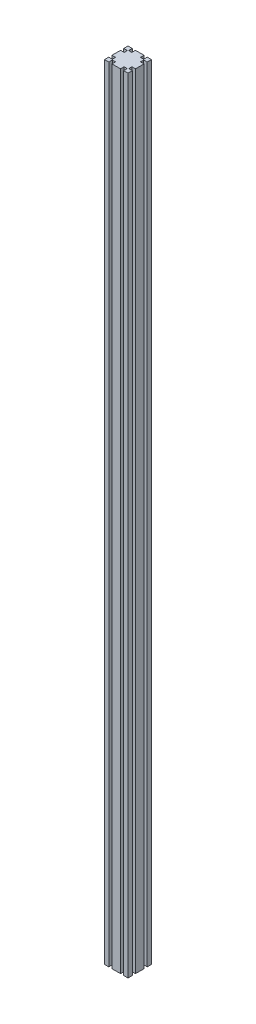
ISO-10303-21;
HEADER;
FILE_DESCRIPTION(('STEP AP214'),'2;1');
FILE_NAME('part.step','',(''),(''),'','','');
FILE_SCHEMA(('AUTOMOTIVE_DESIGN { 1 0 10303 214 1 1 1 1 }'));
ENDSEC;
DATA;
#1=APPLICATION_CONTEXT('core data for automotive mechanical design processes');
#2=APPLICATION_PROTOCOL_DEFINITION('international standard','automotive_design',2000,#1);
#3=PRODUCT_CONTEXT('',#1,'mechanical');
#4=PRODUCT('Part','Part','',(#3));
#5=PRODUCT_RELATED_PRODUCT_CATEGORY('part','',(#4));
#6=PRODUCT_DEFINITION_FORMATION('','',#4);
#7=PRODUCT_DEFINITION_CONTEXT('part definition',#1,'design');
#8=PRODUCT_DEFINITION('design','',#6,#7);
#9=PRODUCT_DEFINITION_SHAPE('','',#8);
#10=(LENGTH_UNIT() NAMED_UNIT(*) SI_UNIT(.MILLI.,.METRE.));
#11=(NAMED_UNIT(*) PLANE_ANGLE_UNIT() SI_UNIT($,.RADIAN.));
#12=(NAMED_UNIT(*) SI_UNIT($,.STERADIAN.) SOLID_ANGLE_UNIT());
#13=UNCERTAINTY_MEASURE_WITH_UNIT(LENGTH_MEASURE(1.E-05),#10,'distance_accuracy_value','');
#14=(GEOMETRIC_REPRESENTATION_CONTEXT(3) GLOBAL_UNCERTAINTY_ASSIGNED_CONTEXT((#13)) GLOBAL_UNIT_ASSIGNED_CONTEXT((#10,
#11,#12)) REPRESENTATION_CONTEXT('',''));
#15=CARTESIAN_POINT('',(0.,0.,0.));
#16=DIRECTION('',(0.,0.,1.));
#17=DIRECTION('',(1.,0.,0.));
#18=AXIS2_PLACEMENT_3D('',#15,#16,#17);
#19=CARTESIAN_POINT('',(19.1,2000.,0.));
#20=DIRECTION('',(-1.,0.,0.));
#21=DIRECTION('',(0.,0.,1.));
#22=AXIS2_PLACEMENT_3D('',#19,#20,#21);
#23=PLANE('',#22);
#24=DIRECTION('',(0.,0.,-1.));
#25=VECTOR('',#24,1.);
#26=CARTESIAN_POINT('',(19.1,0.,0.));
#27=LINE('',#26,#25);
#28=CARTESIAN_POINT('',(19.1,0.,-50.8));
#29=VERTEX_POINT('',#28);
#30=CARTESIAN_POINT('',(19.1,0.,-60.));
#31=VERTEX_POINT('',#30);
#32=EDGE_CURVE('E309',#29,#31,#27,.T.);
#33=ORIENTED_EDGE('',*,*,#32,.F.);
#34=DIRECTION('',(0.,-1.,0.));
#35=VECTOR('',#34,1.);
#36=CARTESIAN_POINT('',(19.1,2000.,-50.8));
#37=LINE('',#36,#35);
#38=CARTESIAN_POINT('',(19.1,2000.,-50.8));
#39=VERTEX_POINT('',#38);
#40=EDGE_CURVE('E11',#39,#29,#37,.T.);
#41=ORIENTED_EDGE('',*,*,#40,.F.);
#42=DIRECTION('',(0.,0.,-1.));
#43=VECTOR('',#42,1.);
#44=CARTESIAN_POINT('',(19.1,2000.,0.));
#45=LINE('',#44,#43);
#46=CARTESIAN_POINT('',(19.1,2000.,-60.));
#47=VERTEX_POINT('',#46);
#48=EDGE_CURVE('E557',#39,#47,#45,.T.);
#49=ORIENTED_EDGE('',*,*,#48,.T.);
#50=DIRECTION('',(0.,-1.,0.));
#51=VECTOR('',#50,1.);
#52=CARTESIAN_POINT('',(19.1,2000.,-60.));
#53=LINE('',#52,#51);
#54=EDGE_CURVE('E58',#47,#31,#53,.T.);
#55=ORIENTED_EDGE('',*,*,#54,.T.);
#56=EDGE_LOOP('',(#33,#41,#49,#55));
#57=FACE_BOUND('',#56,.T.);
#58=ADVANCED_FACE('F41',(#57),#23,.T.);
#59=CARTESIAN_POINT('',(0.,2000.,-50.8));
#60=DIRECTION('',(0.,0.,-1.));
#61=DIRECTION('',(-1.,0.,0.));
#62=AXIS2_PLACEMENT_3D('',#59,#60,#61);
#63=PLANE('',#62);
#64=DIRECTION('',(1.,0.,0.));
#65=VECTOR('',#64,1.);
#66=CARTESIAN_POINT('',(0.,0.,-50.8));
#67=LINE('',#66,#65);
#68=CARTESIAN_POINT('',(10.9,0.,-50.8));
#69=VERTEX_POINT('',#68);
#70=EDGE_CURVE('E312',#69,#29,#67,.T.);
#71=ORIENTED_EDGE('',*,*,#70,.F.);
#72=DIRECTION('',(0.,-1.,0.));
#73=VECTOR('',#72,1.);
#74=CARTESIAN_POINT('',(10.9,2000.,-50.8));
#75=LINE('',#74,#73);
#76=CARTESIAN_POINT('',(10.9,2000.,-50.8));
#77=VERTEX_POINT('',#76);
#78=EDGE_CURVE('E50',#77,#69,#75,.T.);
#79=ORIENTED_EDGE('',*,*,#78,.F.);
#80=DIRECTION('',(1.,0.,0.));
#81=VECTOR('',#80,1.);
#82=CARTESIAN_POINT('',(0.,2000.,-50.8));
#83=LINE('',#82,#81);
#84=EDGE_CURVE('E551',#77,#39,#83,.T.);
#85=ORIENTED_EDGE('',*,*,#84,.T.);
#86=ORIENTED_EDGE('',*,*,#40,.T.);
#87=EDGE_LOOP('',(#71,#79,#85,#86));
#88=FACE_BOUND('',#87,.T.);
#89=ADVANCED_FACE('F540',(#88),#63,.T.);
#90=CARTESIAN_POINT('',(10.9,2000.,0.));
#91=DIRECTION('',(1.,0.,0.));
#92=DIRECTION('',(0.,0.,-1.));
#93=AXIS2_PLACEMENT_3D('',#90,#91,#92);
#94=PLANE('',#93);
#95=DIRECTION('',(0.,0.,1.));
#96=VECTOR('',#95,1.);
#97=CARTESIAN_POINT('',(10.9,0.,0.));
#98=LINE('',#97,#96);
#99=CARTESIAN_POINT('',(10.9,0.,-60.));
#100=VERTEX_POINT('',#99);
#101=EDGE_CURVE('E316',#100,#69,#98,.T.);
#102=ORIENTED_EDGE('',*,*,#101,.F.);
#103=DIRECTION('',(0.,-1.,0.));
#104=VECTOR('',#103,1.);
#105=CARTESIAN_POINT('',(10.9,2000.,-60.));
#106=LINE('',#105,#104);
#107=CARTESIAN_POINT('',(10.9,2000.,-60.));
#108=VERTEX_POINT('',#107);
#109=EDGE_CURVE('E527',#108,#100,#106,.T.);
#110=ORIENTED_EDGE('',*,*,#109,.F.);
#111=DIRECTION('',(0.,0.,1.));
#112=VECTOR('',#111,1.);
#113=CARTESIAN_POINT('',(10.9,2000.,0.));
#114=LINE('',#113,#112);
#115=EDGE_CURVE('E536',#108,#77,#114,.T.);
#116=ORIENTED_EDGE('',*,*,#115,.T.);
#117=ORIENTED_EDGE('',*,*,#78,.T.);
#118=EDGE_LOOP('',(#102,#110,#116,#117));
#119=FACE_BOUND('',#118,.T.);
#120=ADVANCED_FACE('F534',(#119),#94,.T.);
#121=CARTESIAN_POINT('',(0.,2000.,-60.));
#122=DIRECTION('',(0.,0.,-1.));
#123=DIRECTION('',(-1.,0.,0.));
#124=AXIS2_PLACEMENT_3D('',#121,#122,#123);
#125=PLANE('',#124);
#126=DIRECTION('',(1.,0.,0.));
#127=VECTOR('',#126,1.);
#128=CARTESIAN_POINT('',(0.,0.,-60.));
#129=LINE('',#128,#127);
#130=CARTESIAN_POINT('',(0.,0.,-60.));
#131=VERTEX_POINT('',#130);
#132=EDGE_CURVE('E320',#131,#100,#129,.T.);
#133=ORIENTED_EDGE('',*,*,#132,.F.);
#134=DIRECTION('',(0.,-1.,0.));
#135=VECTOR('',#134,1.);
#136=CARTESIAN_POINT('',(0.,2000.,-60.));
#137=LINE('',#136,#135);
#138=CARTESIAN_POINT('',(0.,2000.,-60.));
#139=VERTEX_POINT('',#138);
#140=EDGE_CURVE('E524',#139,#131,#137,.T.);
#141=ORIENTED_EDGE('',*,*,#140,.F.);
#142=DIRECTION('',(1.,0.,0.));
#143=VECTOR('',#142,1.);
#144=CARTESIAN_POINT('',(0.,2000.,-60.));
#145=LINE('',#144,#143);
#146=EDGE_CURVE('E306',#139,#108,#145,.T.);
#147=ORIENTED_EDGE('',*,*,#146,.T.);
#148=ORIENTED_EDGE('',*,*,#109,.T.);
#149=EDGE_LOOP('',(#133,#141,#147,#148));
#150=FACE_BOUND('',#149,.T.);
#151=ADVANCED_FACE('F547',(#150),#125,.T.);
#152=CARTESIAN_POINT('',(0.,2000.,0.));
#153=DIRECTION('',(1.,0.,0.));
#154=DIRECTION('',(0.,0.,-1.));
#155=AXIS2_PLACEMENT_3D('',#152,#153,#154);
#156=PLANE('',#155);
#157=DIRECTION('',(0.,0.,1.));
#158=VECTOR('',#157,1.);
#159=CARTESIAN_POINT('',(0.,0.,0.));
#160=LINE('',#159,#158);
#161=CARTESIAN_POINT('',(0.,0.,-49.1));
#162=VERTEX_POINT('',#161);
#163=EDGE_CURVE('E324',#131,#162,#160,.T.);
#164=ORIENTED_EDGE('',*,*,#163,.T.);
#165=DIRECTION('',(0.,-1.,0.));
#166=VECTOR('',#165,1.);
#167=CARTESIAN_POINT('',(0.,2000.,-49.1));
#168=LINE('',#167,#166);
#169=CARTESIAN_POINT('',(0.,2000.,-49.1));
#170=VERTEX_POINT('',#169);
#171=EDGE_CURVE('E520',#170,#162,#168,.T.);
#172=ORIENTED_EDGE('',*,*,#171,.F.);
#173=DIRECTION('',(0.,0.,1.));
#174=VECTOR('',#173,1.);
#175=CARTESIAN_POINT('',(0.,2000.,0.));
#176=LINE('',#175,#174);
#177=EDGE_CURVE('E556',#139,#170,#176,.T.);
#178=ORIENTED_EDGE('',*,*,#177,.F.);
#179=ORIENTED_EDGE('',*,*,#140,.T.);
#180=EDGE_LOOP('',(#164,#172,#178,#179));
#181=FACE_BOUND('',#180,.T.);
#182=ADVANCED_FACE('F741',(#181),#156,.F.);
#183=CARTESIAN_POINT('',(0.,2000.,-49.1));
#184=DIRECTION('',(0.,0.,-1.));
#185=DIRECTION('',(-1.,0.,0.));
#186=AXIS2_PLACEMENT_3D('',#183,#184,#185);
#187=PLANE('',#186);
#188=DIRECTION('',(1.,0.,0.));
#189=VECTOR('',#188,1.);
#190=CARTESIAN_POINT('',(0.,0.,-49.1));
#191=LINE('',#190,#189);
#192=CARTESIAN_POINT('',(9.2,0.,-49.1));
#193=VERTEX_POINT('',#192);
#194=EDGE_CURVE('E328',#162,#193,#191,.T.);
#195=ORIENTED_EDGE('',*,*,#194,.T.);
#196=DIRECTION('',(0.,-1.,0.));
#197=VECTOR('',#196,1.);
#198=CARTESIAN_POINT('',(9.2,2000.,-49.1));
#199=LINE('',#198,#197);
#200=CARTESIAN_POINT('',(9.2,2000.,-49.1));
#201=VERTEX_POINT('',#200);
#202=EDGE_CURVE('E516',#201,#193,#199,.T.);
#203=ORIENTED_EDGE('',*,*,#202,.F.);
#204=DIRECTION('',(1.,0.,0.));
#205=VECTOR('',#204,1.);
#206=CARTESIAN_POINT('',(0.,2000.,-49.1));
#207=LINE('',#206,#205);
#208=EDGE_CURVE('E563',#170,#201,#207,.T.);
#209=ORIENTED_EDGE('',*,*,#208,.F.);
#210=ORIENTED_EDGE('',*,*,#171,.T.);
#211=EDGE_LOOP('',(#195,#203,#209,#210));
#212=FACE_BOUND('',#211,.T.);
#213=ADVANCED_FACE('F753',(#212),#187,.F.);
#214=CARTESIAN_POINT('',(9.20000000000001,2000.,0.));
#215=DIRECTION('',(1.,0.,0.));
#216=DIRECTION('',(0.,0.,-1.));
#217=AXIS2_PLACEMENT_3D('',#214,#215,#216);
#218=PLANE('',#217);
#219=DIRECTION('',(0.,0.,1.));
#220=VECTOR('',#219,1.);
#221=CARTESIAN_POINT('',(9.20000000000001,0.,0.));
#222=LINE('',#221,#220);
#223=CARTESIAN_POINT('',(9.2,0.,-40.9));
#224=VERTEX_POINT('',#223);
#225=EDGE_CURVE('E331',#193,#224,#222,.T.);
#226=ORIENTED_EDGE('',*,*,#225,.T.);
#227=DIRECTION('',(0.,-1.,0.));
#228=VECTOR('',#227,1.);
#229=CARTESIAN_POINT('',(9.2,2000.,-40.9));
#230=LINE('',#229,#228);
#231=CARTESIAN_POINT('',(9.2,2000.,-40.9));
#232=VERTEX_POINT('',#231);
#233=EDGE_CURVE('E512',#232,#224,#230,.T.);
#234=ORIENTED_EDGE('',*,*,#233,.F.);
#235=DIRECTION('',(0.,0.,1.));
#236=VECTOR('',#235,1.);
#237=CARTESIAN_POINT('',(9.20000000000001,2000.,0.));
#238=LINE('',#237,#236);
#239=EDGE_CURVE('E566',#201,#232,#238,.T.);
#240=ORIENTED_EDGE('',*,*,#239,.F.);
#241=ORIENTED_EDGE('',*,*,#202,.T.);
#242=EDGE_LOOP('',(#226,#234,#240,#241));
#243=FACE_BOUND('',#242,.T.);
#244=ADVANCED_FACE('F757',(#243),#218,.F.);
#245=CARTESIAN_POINT('',(0.,2000.,-40.9));
#246=DIRECTION('',(0.,0.,1.));
#247=DIRECTION('',(1.,0.,0.));
#248=AXIS2_PLACEMENT_3D('',#245,#246,#247);
#249=PLANE('',#248);
#250=DIRECTION('',(-1.,0.,0.));
#251=VECTOR('',#250,1.);
#252=CARTESIAN_POINT('',(0.,0.,-40.9));
#253=LINE('',#252,#251);
#254=CARTESIAN_POINT('',(0.,0.,-40.9));
#255=VERTEX_POINT('',#254);
#256=EDGE_CURVE('E334',#224,#255,#253,.T.);
#257=ORIENTED_EDGE('',*,*,#256,.T.);
#258=DIRECTION('',(0.,-1.,0.));
#259=VECTOR('',#258,1.);
#260=CARTESIAN_POINT('',(0.,2000.,-40.9));
#261=LINE('',#260,#259);
#262=CARTESIAN_POINT('',(0.,2000.,-40.9));
#263=VERTEX_POINT('',#262);
#264=EDGE_CURVE('E509',#263,#255,#261,.T.);
#265=ORIENTED_EDGE('',*,*,#264,.F.);
#266=DIRECTION('',(-1.,0.,0.));
#267=VECTOR('',#266,1.);
#268=CARTESIAN_POINT('',(0.,2000.,-40.9));
#269=LINE('',#268,#267);
#270=EDGE_CURVE('E569',#232,#263,#269,.T.);
#271=ORIENTED_EDGE('',*,*,#270,.F.);
#272=ORIENTED_EDGE('',*,*,#233,.T.);
#273=EDGE_LOOP('',(#257,#265,#271,#272));
#274=FACE_BOUND('',#273,.T.);
#275=ADVANCED_FACE('F761',(#274),#249,.F.);
#276=CARTESIAN_POINT('',(0.,2000.,0.));
#277=DIRECTION('',(-1.,0.,0.));
#278=DIRECTION('',(0.,0.,1.));
#279=AXIS2_PLACEMENT_3D('',#276,#277,#278);
#280=PLANE('',#279);
#281=DIRECTION('',(0.,0.,-1.));
#282=VECTOR('',#281,1.);
#283=CARTESIAN_POINT('',(0.,0.,0.));
#284=LINE('',#283,#282);
#285=CARTESIAN_POINT('',(0.,0.,-19.1));
#286=VERTEX_POINT('',#285);
#287=EDGE_CURVE('E338',#286,#255,#284,.T.);
#288=ORIENTED_EDGE('',*,*,#287,.F.);
#289=DIRECTION('',(0.,-1.,0.));
#290=VECTOR('',#289,1.);
#291=CARTESIAN_POINT('',(0.,2000.,-19.1));
#292=LINE('',#291,#290);
#293=CARTESIAN_POINT('',(0.,2000.,-19.1));
#294=VERTEX_POINT('',#293);
#295=EDGE_CURVE('E506',#294,#286,#292,.T.);
#296=ORIENTED_EDGE('',*,*,#295,.F.);
#297=DIRECTION('',(0.,0.,-1.));
#298=VECTOR('',#297,1.);
#299=CARTESIAN_POINT('',(0.,2000.,0.));
#300=LINE('',#299,#298);
#301=EDGE_CURVE('E572',#294,#263,#300,.T.);
#302=ORIENTED_EDGE('',*,*,#301,.T.);
#303=ORIENTED_EDGE('',*,*,#264,.T.);
#304=EDGE_LOOP('',(#288,#296,#302,#303));
#305=FACE_BOUND('',#304,.T.);
#306=ADVANCED_FACE('F765',(#305),#280,.T.);
#307=CARTESIAN_POINT('',(0.,2000.,-19.1));
#308=DIRECTION('',(0.,0.,1.));
#309=DIRECTION('',(1.,0.,0.));
#310=AXIS2_PLACEMENT_3D('',#307,#308,#309);
#311=PLANE('',#310);
#312=DIRECTION('',(-1.,0.,0.));
#313=VECTOR('',#312,1.);
#314=CARTESIAN_POINT('',(0.,0.,-19.1));
#315=LINE('',#314,#313);
#316=CARTESIAN_POINT('',(9.20000000000002,0.,-19.1));
#317=VERTEX_POINT('',#316);
#318=EDGE_CURVE('E342',#317,#286,#315,.T.);
#319=ORIENTED_EDGE('',*,*,#318,.F.);
#320=DIRECTION('',(0.,-1.,0.));
#321=VECTOR('',#320,1.);
#322=CARTESIAN_POINT('',(9.20000000000002,2000.,-19.1));
#323=LINE('',#322,#321);
#324=CARTESIAN_POINT('',(9.20000000000002,2000.,-19.1));
#325=VERTEX_POINT('',#324);
#326=EDGE_CURVE('E503',#325,#317,#323,.T.);
#327=ORIENTED_EDGE('',*,*,#326,.F.);
#328=DIRECTION('',(-1.,0.,0.));
#329=VECTOR('',#328,1.);
#330=CARTESIAN_POINT('',(0.,2000.,-19.1));
#331=LINE('',#330,#329);
#332=EDGE_CURVE('E576',#325,#294,#331,.T.);
#333=ORIENTED_EDGE('',*,*,#332,.T.);
#334=ORIENTED_EDGE('',*,*,#295,.T.);
#335=EDGE_LOOP('',(#319,#327,#333,#334));
#336=FACE_BOUND('',#335,.T.);
#337=ADVANCED_FACE('F769',(#336),#311,.T.);
#338=CARTESIAN_POINT('',(9.2,2000.,0.));
#339=DIRECTION('',(-1.,0.,0.));
#340=DIRECTION('',(0.,0.,1.));
#341=AXIS2_PLACEMENT_3D('',#338,#339,#340);
#342=PLANE('',#341);
#343=DIRECTION('',(0.,0.,-1.));
#344=VECTOR('',#343,1.);
#345=CARTESIAN_POINT('',(9.2,0.,0.));
#346=LINE('',#345,#344);
#347=CARTESIAN_POINT('',(9.20000000000001,0.,-10.9));
#348=VERTEX_POINT('',#347);
#349=EDGE_CURVE('E346',#348,#317,#346,.T.);
#350=ORIENTED_EDGE('',*,*,#349,.F.);
#351=DIRECTION('',(0.,-1.,0.));
#352=VECTOR('',#351,1.);
#353=CARTESIAN_POINT('',(9.20000000000001,2000.,-10.9));
#354=LINE('',#353,#352);
#355=CARTESIAN_POINT('',(9.20000000000001,2000.,-10.9));
#356=VERTEX_POINT('',#355);
#357=EDGE_CURVE('E500',#356,#348,#354,.T.);
#358=ORIENTED_EDGE('',*,*,#357,.F.);
#359=DIRECTION('',(0.,0.,-1.));
#360=VECTOR('',#359,1.);
#361=CARTESIAN_POINT('',(9.2,2000.,0.));
#362=LINE('',#361,#360);
#363=EDGE_CURVE('E580',#356,#325,#362,.T.);
#364=ORIENTED_EDGE('',*,*,#363,.T.);
#365=ORIENTED_EDGE('',*,*,#326,.T.);
#366=EDGE_LOOP('',(#350,#358,#364,#365));
#367=FACE_BOUND('',#366,.T.);
#368=ADVANCED_FACE('F773',(#367),#342,.T.);
#369=CARTESIAN_POINT('',(0.,2000.,-10.9));
#370=DIRECTION('',(0.,0.,-1.));
#371=DIRECTION('',(-1.,0.,0.));
#372=AXIS2_PLACEMENT_3D('',#369,#370,#371);
#373=PLANE('',#372);
#374=DIRECTION('',(1.,0.,0.));
#375=VECTOR('',#374,1.);
#376=CARTESIAN_POINT('',(0.,0.,-10.9));
#377=LINE('',#376,#375);
#378=CARTESIAN_POINT('',(0.,0.,-10.9));
#379=VERTEX_POINT('',#378);
#380=EDGE_CURVE('E350',#379,#348,#377,.T.);
#381=ORIENTED_EDGE('',*,*,#380,.F.);
#382=DIRECTION('',(0.,-1.,0.));
#383=VECTOR('',#382,1.);
#384=CARTESIAN_POINT('',(0.,2000.,-10.9));
#385=LINE('',#384,#383);
#386=CARTESIAN_POINT('',(0.,2000.,-10.9));
#387=VERTEX_POINT('',#386);
#388=EDGE_CURVE('E497',#387,#379,#385,.T.);
#389=ORIENTED_EDGE('',*,*,#388,.F.);
#390=DIRECTION('',(1.,0.,0.));
#391=VECTOR('',#390,1.);
#392=CARTESIAN_POINT('',(0.,2000.,-10.9));
#393=LINE('',#392,#391);
#394=EDGE_CURVE('E584',#387,#356,#393,.T.);
#395=ORIENTED_EDGE('',*,*,#394,.T.);
#396=ORIENTED_EDGE('',*,*,#357,.T.);
#397=EDGE_LOOP('',(#381,#389,#395,#396));
#398=FACE_BOUND('',#397,.T.);
#399=ADVANCED_FACE('F777',(#398),#373,.T.);
#400=CARTESIAN_POINT('',(0.,2000.,0.));
#401=DIRECTION('',(-1.,0.,0.));
#402=DIRECTION('',(0.,0.,1.));
#403=AXIS2_PLACEMENT_3D('',#400,#401,#402);
#404=PLANE('',#403);
#405=DIRECTION('',(0.,0.,-1.));
#406=VECTOR('',#405,1.);
#407=CARTESIAN_POINT('',(0.,0.,0.));
#408=LINE('',#407,#406);
#409=CARTESIAN_POINT('',(0.,0.,0.));
#410=VERTEX_POINT('',#409);
#411=EDGE_CURVE('E354',#410,#379,#408,.T.);
#412=ORIENTED_EDGE('',*,*,#411,.F.);
#413=DIRECTION('',(0.,-1.,0.));
#414=VECTOR('',#413,1.);
#415=CARTESIAN_POINT('',(0.,2000.,0.));
#416=LINE('',#415,#414);
#417=CARTESIAN_POINT('',(0.,2000.,0.));
#418=VERTEX_POINT('',#417);
#419=EDGE_CURVE('E494',#418,#410,#416,.T.);
#420=ORIENTED_EDGE('',*,*,#419,.F.);
#421=DIRECTION('',(0.,0.,-1.));
#422=VECTOR('',#421,1.);
#423=CARTESIAN_POINT('',(0.,2000.,0.));
#424=LINE('',#423,#422);
#425=EDGE_CURVE('E588',#418,#387,#424,.T.);
#426=ORIENTED_EDGE('',*,*,#425,.T.);
#427=ORIENTED_EDGE('',*,*,#388,.T.);
#428=EDGE_LOOP('',(#412,#420,#426,#427));
#429=FACE_BOUND('',#428,.T.);
#430=ADVANCED_FACE('F781',(#429),#404,.T.);
#431=CARTESIAN_POINT('',(0.,2000.,0.));
#432=DIRECTION('',(0.,0.,-1.));
#433=DIRECTION('',(-1.,0.,0.));
#434=AXIS2_PLACEMENT_3D('',#431,#432,#433);
#435=PLANE('',#434);
#436=DIRECTION('',(1.,0.,0.));
#437=VECTOR('',#436,1.);
#438=CARTESIAN_POINT('',(0.,0.,0.));
#439=LINE('',#438,#437);
#440=CARTESIAN_POINT('',(10.9,0.,0.));
#441=VERTEX_POINT('',#440);
#442=EDGE_CURVE('E358',#410,#441,#439,.T.);
#443=ORIENTED_EDGE('',*,*,#442,.T.);
#444=DIRECTION('',(0.,-1.,0.));
#445=VECTOR('',#444,1.);
#446=CARTESIAN_POINT('',(10.9,2000.,0.));
#447=LINE('',#446,#445);
#448=CARTESIAN_POINT('',(10.9,2000.,0.));
#449=VERTEX_POINT('',#448);
#450=EDGE_CURVE('E490',#449,#441,#447,.T.);
#451=ORIENTED_EDGE('',*,*,#450,.F.);
#452=DIRECTION('',(1.,0.,0.));
#453=VECTOR('',#452,1.);
#454=CARTESIAN_POINT('',(0.,2000.,0.));
#455=LINE('',#454,#453);
#456=EDGE_CURVE('E592',#418,#449,#455,.T.);
#457=ORIENTED_EDGE('',*,*,#456,.F.);
#458=ORIENTED_EDGE('',*,*,#419,.T.);
#459=EDGE_LOOP('',(#443,#451,#457,#458));
#460=FACE_BOUND('',#459,.T.);
#461=ADVANCED_FACE('F785',(#460),#435,.F.);
#462=CARTESIAN_POINT('',(10.9,2000.,0.));
#463=DIRECTION('',(-1.,0.,0.));
#464=DIRECTION('',(0.,0.,1.));
#465=AXIS2_PLACEMENT_3D('',#462,#463,#464);
#466=PLANE('',#465);
#467=DIRECTION('',(0.,0.,-1.));
#468=VECTOR('',#467,1.);
#469=CARTESIAN_POINT('',(10.9,0.,0.));
#470=LINE('',#469,#468);
#471=CARTESIAN_POINT('',(10.9,0.,-9.20000000000001));
#472=VERTEX_POINT('',#471);
#473=EDGE_CURVE('E361',#441,#472,#470,.T.);
#474=ORIENTED_EDGE('',*,*,#473,.T.);
#475=DIRECTION('',(0.,-1.,0.));
#476=VECTOR('',#475,1.);
#477=CARTESIAN_POINT('',(10.9,2000.,-9.20000000000001));
#478=LINE('',#477,#476);
#479=CARTESIAN_POINT('',(10.9,2000.,-9.20000000000001));
#480=VERTEX_POINT('',#479);
#481=EDGE_CURVE('E486',#480,#472,#478,.T.);
#482=ORIENTED_EDGE('',*,*,#481,.F.);
#483=DIRECTION('',(0.,0.,-1.));
#484=VECTOR('',#483,1.);
#485=CARTESIAN_POINT('',(10.9,2000.,0.));
#486=LINE('',#485,#484);
#487=EDGE_CURVE('E595',#449,#480,#486,.T.);
#488=ORIENTED_EDGE('',*,*,#487,.F.);
#489=ORIENTED_EDGE('',*,*,#450,.T.);
#490=EDGE_LOOP('',(#474,#482,#488,#489));
#491=FACE_BOUND('',#490,.T.);
#492=ADVANCED_FACE('F787',(#491),#466,.F.);
#493=CARTESIAN_POINT('',(0.,2000.,-9.19999999999999));
#494=DIRECTION('',(0.,0.,-1.));
#495=DIRECTION('',(-1.,0.,0.));
#496=AXIS2_PLACEMENT_3D('',#493,#494,#495);
#497=PLANE('',#496);
#498=DIRECTION('',(1.,0.,0.));
#499=VECTOR('',#498,1.);
#500=CARTESIAN_POINT('',(0.,0.,-9.19999999999999));
#501=LINE('',#500,#499);
#502=CARTESIAN_POINT('',(19.1,0.,-9.20000000000003));
#503=VERTEX_POINT('',#502);
#504=EDGE_CURVE('E366',#472,#503,#501,.T.);
#505=ORIENTED_EDGE('',*,*,#504,.T.);
#506=DIRECTION('',(0.,-1.,0.));
#507=VECTOR('',#506,1.);
#508=CARTESIAN_POINT('',(19.1,2000.,-9.20000000000003));
#509=LINE('',#508,#507);
#510=CARTESIAN_POINT('',(19.1,2000.,-9.20000000000003));
#511=VERTEX_POINT('',#510);
#512=EDGE_CURVE('E482',#511,#503,#509,.T.);
#513=ORIENTED_EDGE('',*,*,#512,.F.);
#514=DIRECTION('',(1.,0.,0.));
#515=VECTOR('',#514,1.);
#516=CARTESIAN_POINT('',(0.,2000.,-9.19999999999999));
#517=LINE('',#516,#515);
#518=EDGE_CURVE('E600',#480,#511,#517,.T.);
#519=ORIENTED_EDGE('',*,*,#518,.F.);
#520=ORIENTED_EDGE('',*,*,#481,.T.);
#521=EDGE_LOOP('',(#505,#513,#519,#520));
#522=FACE_BOUND('',#521,.T.);
#523=ADVANCED_FACE('F790',(#522),#497,.F.);
#524=CARTESIAN_POINT('',(19.1,2000.,0.));
#525=DIRECTION('',(1.,0.,0.));
#526=DIRECTION('',(0.,0.,-1.));
#527=AXIS2_PLACEMENT_3D('',#524,#525,#526);
#528=PLANE('',#527);
#529=DIRECTION('',(0.,0.,1.));
#530=VECTOR('',#529,1.);
#531=CARTESIAN_POINT('',(19.1,0.,0.));
#532=LINE('',#531,#530);
#533=CARTESIAN_POINT('',(19.1,0.,0.));
#534=VERTEX_POINT('',#533);
#535=EDGE_CURVE('E369',#503,#534,#532,.T.);
#536=ORIENTED_EDGE('',*,*,#535,.T.);
#537=DIRECTION('',(0.,-1.,0.));
#538=VECTOR('',#537,1.);
#539=CARTESIAN_POINT('',(19.1,2000.,0.));
#540=LINE('',#539,#538);
#541=CARTESIAN_POINT('',(19.1,2000.,0.));
#542=VERTEX_POINT('',#541);
#543=EDGE_CURVE('E478',#542,#534,#540,.T.);
#544=ORIENTED_EDGE('',*,*,#543,.F.);
#545=DIRECTION('',(0.,0.,1.));
#546=VECTOR('',#545,1.);
#547=CARTESIAN_POINT('',(19.1,2000.,0.));
#548=LINE('',#547,#546);
#549=EDGE_CURVE('E603',#511,#542,#548,.T.);
#550=ORIENTED_EDGE('',*,*,#549,.F.);
#551=ORIENTED_EDGE('',*,*,#512,.T.);
#552=EDGE_LOOP('',(#536,#544,#550,#551));
#553=FACE_BOUND('',#552,.T.);
#554=ADVANCED_FACE('F794',(#553),#528,.F.);
#555=CARTESIAN_POINT('',(40.9,0.,0.));
#556=VERTEX_POINT('',#555);
#557=EDGE_CURVE('E363',#534,#556,#439,.T.);
#558=ORIENTED_EDGE('',*,*,#557,.T.);
#559=DIRECTION('',(0.,-1.,0.));
#560=VECTOR('',#559,1.);
#561=CARTESIAN_POINT('',(40.9,2000.,0.));
#562=LINE('',#561,#560);
#563=CARTESIAN_POINT('',(40.9,2000.,0.));
#564=VERTEX_POINT('',#563);
#565=EDGE_CURVE('E475',#564,#556,#562,.T.);
#566=ORIENTED_EDGE('',*,*,#565,.F.);
#567=EDGE_CURVE('E597',#542,#564,#455,.T.);
#568=ORIENTED_EDGE('',*,*,#567,.F.);
#569=ORIENTED_EDGE('',*,*,#543,.T.);
#570=EDGE_LOOP('',(#558,#566,#568,#569));
#571=FACE_BOUND('',#570,.T.);
#572=ADVANCED_FACE('F660',(#571),#435,.F.);
#573=CARTESIAN_POINT('',(40.9,2000.,0.));
#574=DIRECTION('',(1.,0.,0.));
#575=DIRECTION('',(0.,0.,-1.));
#576=AXIS2_PLACEMENT_3D('',#573,#574,#575);
#577=PLANE('',#576);
#578=DIRECTION('',(0.,0.,1.));
#579=VECTOR('',#578,1.);
#580=CARTESIAN_POINT('',(40.9,0.,0.));
#581=LINE('',#580,#579);
#582=CARTESIAN_POINT('',(40.9,0.,-9.19999999999999));
#583=VERTEX_POINT('',#582);
#584=EDGE_CURVE('E372',#583,#556,#581,.T.);
#585=ORIENTED_EDGE('',*,*,#584,.F.);
#586=DIRECTION('',(0.,-1.,0.));
#587=VECTOR('',#586,1.);
#588=CARTESIAN_POINT('',(40.9,2000.,-9.19999999999999));
#589=LINE('',#588,#587);
#590=CARTESIAN_POINT('',(40.9,2000.,-9.19999999999999));
#591=VERTEX_POINT('',#590);
#592=EDGE_CURVE('E472',#591,#583,#589,.T.);
#593=ORIENTED_EDGE('',*,*,#592,.F.);
#594=DIRECTION('',(0.,0.,1.));
#595=VECTOR('',#594,1.);
#596=CARTESIAN_POINT('',(40.9,2000.,0.));
#597=LINE('',#596,#595);
#598=EDGE_CURVE('E606',#591,#564,#597,.T.);
#599=ORIENTED_EDGE('',*,*,#598,.T.);
#600=ORIENTED_EDGE('',*,*,#565,.T.);
#601=EDGE_LOOP('',(#585,#593,#599,#600));
#602=FACE_BOUND('',#601,.T.);
#603=ADVANCED_FACE('F664',(#602),#577,.T.);
#604=CARTESIAN_POINT('',(0.,2000.,-9.19999999999999));
#605=DIRECTION('',(0.,0.,1.));
#606=DIRECTION('',(1.,0.,0.));
#607=AXIS2_PLACEMENT_3D('',#604,#605,#606);
#608=PLANE('',#607);
#609=DIRECTION('',(-1.,0.,0.));
#610=VECTOR('',#609,1.);
#611=CARTESIAN_POINT('',(0.,0.,-9.19999999999999));
#612=LINE('',#611,#610);
#613=CARTESIAN_POINT('',(49.1,0.,-9.19999999999999));
#614=VERTEX_POINT('',#613);
#615=EDGE_CURVE('E376',#614,#583,#612,.T.);
#616=ORIENTED_EDGE('',*,*,#615,.F.);
#617=DIRECTION('',(0.,-1.,0.));
#618=VECTOR('',#617,1.);
#619=CARTESIAN_POINT('',(49.1,2000.,-9.19999999999999));
#620=LINE('',#619,#618);
#621=CARTESIAN_POINT('',(49.1,2000.,-9.19999999999999));
#622=VERTEX_POINT('',#621);
#623=EDGE_CURVE('E469',#622,#614,#620,.T.);
#624=ORIENTED_EDGE('',*,*,#623,.F.);
#625=DIRECTION('',(-1.,0.,0.));
#626=VECTOR('',#625,1.);
#627=CARTESIAN_POINT('',(0.,2000.,-9.19999999999999));
#628=LINE('',#627,#626);
#629=EDGE_CURVE('E610',#622,#591,#628,.T.);
#630=ORIENTED_EDGE('',*,*,#629,.T.);
#631=ORIENTED_EDGE('',*,*,#592,.T.);
#632=EDGE_LOOP('',(#616,#624,#630,#631));
#633=FACE_BOUND('',#632,.T.);
#634=ADVANCED_FACE('F667',(#633),#608,.T.);
#635=CARTESIAN_POINT('',(49.1,2000.,0.));
#636=DIRECTION('',(-1.,0.,0.));
#637=DIRECTION('',(0.,0.,1.));
#638=AXIS2_PLACEMENT_3D('',#635,#636,#637);
#639=PLANE('',#638);
#640=DIRECTION('',(0.,0.,-1.));
#641=VECTOR('',#640,1.);
#642=CARTESIAN_POINT('',(49.1,0.,0.));
#643=LINE('',#642,#641);
#644=CARTESIAN_POINT('',(49.1,0.,0.));
#645=VERTEX_POINT('',#644);
#646=EDGE_CURVE('E380',#645,#614,#643,.T.);
#647=ORIENTED_EDGE('',*,*,#646,.F.);
#648=DIRECTION('',(0.,-1.,0.));
#649=VECTOR('',#648,1.);
#650=CARTESIAN_POINT('',(49.1,2000.,0.));
#651=LINE('',#650,#649);
#652=CARTESIAN_POINT('',(49.1,2000.,0.));
#653=VERTEX_POINT('',#652);
#654=EDGE_CURVE('E466',#653,#645,#651,.T.);
#655=ORIENTED_EDGE('',*,*,#654,.F.);
#656=DIRECTION('',(0.,0.,-1.));
#657=VECTOR('',#656,1.);
#658=CARTESIAN_POINT('',(49.1,2000.,0.));
#659=LINE('',#658,#657);
#660=EDGE_CURVE('E614',#653,#622,#659,.T.);
#661=ORIENTED_EDGE('',*,*,#660,.T.);
#662=ORIENTED_EDGE('',*,*,#623,.T.);
#663=EDGE_LOOP('',(#647,#655,#661,#662));
#664=FACE_BOUND('',#663,.T.);
#665=ADVANCED_FACE('F671',(#664),#639,.T.);
#666=CARTESIAN_POINT('',(60.,0.,0.));
#667=VERTEX_POINT('',#666);
#668=EDGE_CURVE('E362',#645,#667,#439,.T.);
#669=ORIENTED_EDGE('',*,*,#668,.T.);
#670=DIRECTION('',(0.,-1.,0.));
#671=VECTOR('',#670,1.);
#672=CARTESIAN_POINT('',(60.,2000.,0.));
#673=LINE('',#672,#671);
#674=CARTESIAN_POINT('',(60.,2000.,0.));
#675=VERTEX_POINT('',#674);
#676=EDGE_CURVE('E462',#675,#667,#673,.T.);
#677=ORIENTED_EDGE('',*,*,#676,.F.);
#678=EDGE_CURVE('E596',#653,#675,#455,.T.);
#679=ORIENTED_EDGE('',*,*,#678,.F.);
#680=ORIENTED_EDGE('',*,*,#654,.T.);
#681=EDGE_LOOP('',(#669,#677,#679,#680));
#682=FACE_BOUND('',#681,.T.);
#683=ADVANCED_FACE('F676',(#682),#435,.F.);
#684=CARTESIAN_POINT('',(60.,2000.,0.));
#685=DIRECTION('',(-1.,0.,0.));
#686=DIRECTION('',(0.,0.,1.));
#687=AXIS2_PLACEMENT_3D('',#684,#685,#686);
#688=PLANE('',#687);
#689=DIRECTION('',(0.,0.,-1.));
#690=VECTOR('',#689,1.);
#691=CARTESIAN_POINT('',(60.,0.,0.));
#692=LINE('',#691,#690);
#693=CARTESIAN_POINT('',(60.,0.,-10.9));
#694=VERTEX_POINT('',#693);
#695=EDGE_CURVE('E384',#667,#694,#692,.T.);
#696=ORIENTED_EDGE('',*,*,#695,.T.);
#697=DIRECTION('',(0.,-1.,0.));
#698=VECTOR('',#697,1.);
#699=CARTESIAN_POINT('',(60.,2000.,-10.9));
#700=LINE('',#699,#698);
#701=CARTESIAN_POINT('',(60.,2000.,-10.9));
#702=VERTEX_POINT('',#701);
#703=EDGE_CURVE('E458',#702,#694,#700,.T.);
#704=ORIENTED_EDGE('',*,*,#703,.F.);
#705=DIRECTION('',(0.,0.,-1.));
#706=VECTOR('',#705,1.);
#707=CARTESIAN_POINT('',(60.,2000.,0.));
#708=LINE('',#707,#706);
#709=EDGE_CURVE('E618',#675,#702,#708,.T.);
#710=ORIENTED_EDGE('',*,*,#709,.F.);
#711=ORIENTED_EDGE('',*,*,#676,.T.);
#712=EDGE_LOOP('',(#696,#704,#710,#711));
#713=FACE_BOUND('',#712,.T.);
#714=ADVANCED_FACE('F682',(#713),#688,.F.);
#715=CARTESIAN_POINT('',(0.,2000.,-10.9));
#716=DIRECTION('',(0.,0.,1.));
#717=DIRECTION('',(1.,0.,0.));
#718=AXIS2_PLACEMENT_3D('',#715,#716,#717);
#719=PLANE('',#718);
#720=DIRECTION('',(-1.,0.,0.));
#721=VECTOR('',#720,1.);
#722=CARTESIAN_POINT('',(0.,0.,-10.9));
#723=LINE('',#722,#721);
#724=CARTESIAN_POINT('',(50.8,0.,-10.9));
#725=VERTEX_POINT('',#724);
#726=EDGE_CURVE('E387',#694,#725,#723,.T.);
#727=ORIENTED_EDGE('',*,*,#726,.T.);
#728=DIRECTION('',(0.,-1.,0.));
#729=VECTOR('',#728,1.);
#730=CARTESIAN_POINT('',(50.8,2000.,-10.9));
#731=LINE('',#730,#729);
#732=CARTESIAN_POINT('',(50.8,2000.,-10.9));
#733=VERTEX_POINT('',#732);
#734=EDGE_CURVE('E454',#733,#725,#731,.T.);
#735=ORIENTED_EDGE('',*,*,#734,.F.);
#736=DIRECTION('',(-1.,0.,0.));
#737=VECTOR('',#736,1.);
#738=CARTESIAN_POINT('',(0.,2000.,-10.9));
#739=LINE('',#738,#737);
#740=EDGE_CURVE('E621',#702,#733,#739,.T.);
#741=ORIENTED_EDGE('',*,*,#740,.F.);
#742=ORIENTED_EDGE('',*,*,#703,.T.);
#743=EDGE_LOOP('',(#727,#735,#741,#742));
#744=FACE_BOUND('',#743,.T.);
#745=ADVANCED_FACE('F686',(#744),#719,.F.);
#746=CARTESIAN_POINT('',(50.8,2000.,0.));
#747=DIRECTION('',(-1.,0.,0.));
#748=DIRECTION('',(0.,0.,1.));
#749=AXIS2_PLACEMENT_3D('',#746,#747,#748);
#750=PLANE('',#749);
#751=DIRECTION('',(0.,0.,-1.));
#752=VECTOR('',#751,1.);
#753=CARTESIAN_POINT('',(50.8,0.,0.));
#754=LINE('',#753,#752);
#755=CARTESIAN_POINT('',(50.8,0.,-19.1));
#756=VERTEX_POINT('',#755);
#757=EDGE_CURVE('E392',#725,#756,#754,.T.);
#758=ORIENTED_EDGE('',*,*,#757,.T.);
#759=DIRECTION('',(0.,-1.,0.));
#760=VECTOR('',#759,1.);
#761=CARTESIAN_POINT('',(50.8,2000.,-19.1));
#762=LINE('',#761,#760);
#763=CARTESIAN_POINT('',(50.8,2000.,-19.1));
#764=VERTEX_POINT('',#763);
#765=EDGE_CURVE('E450',#764,#756,#762,.T.);
#766=ORIENTED_EDGE('',*,*,#765,.F.);
#767=DIRECTION('',(0.,0.,-1.));
#768=VECTOR('',#767,1.);
#769=CARTESIAN_POINT('',(50.8,2000.,0.));
#770=LINE('',#769,#768);
#771=EDGE_CURVE('E626',#733,#764,#770,.T.);
#772=ORIENTED_EDGE('',*,*,#771,.F.);
#773=ORIENTED_EDGE('',*,*,#734,.T.);
#774=EDGE_LOOP('',(#758,#766,#772,#773));
#775=FACE_BOUND('',#774,.T.);
#776=ADVANCED_FACE('F691',(#775),#750,.F.);
#777=CARTESIAN_POINT('',(0.,2000.,-19.1));
#778=DIRECTION('',(0.,0.,-1.));
#779=DIRECTION('',(-1.,0.,0.));
#780=AXIS2_PLACEMENT_3D('',#777,#778,#779);
#781=PLANE('',#780);
#782=DIRECTION('',(1.,0.,0.));
#783=VECTOR('',#782,1.);
#784=CARTESIAN_POINT('',(0.,0.,-19.1));
#785=LINE('',#784,#783);
#786=CARTESIAN_POINT('',(60.,0.,-19.1));
#787=VERTEX_POINT('',#786);
#788=EDGE_CURVE('E395',#756,#787,#785,.T.);
#789=ORIENTED_EDGE('',*,*,#788,.T.);
#790=DIRECTION('',(0.,-1.,0.));
#791=VECTOR('',#790,1.);
#792=CARTESIAN_POINT('',(60.,2000.,-19.1));
#793=LINE('',#792,#791);
#794=CARTESIAN_POINT('',(60.,2000.,-19.1));
#795=VERTEX_POINT('',#794);
#796=EDGE_CURVE('E446',#795,#787,#793,.T.);
#797=ORIENTED_EDGE('',*,*,#796,.F.);
#798=DIRECTION('',(1.,0.,0.));
#799=VECTOR('',#798,1.);
#800=CARTESIAN_POINT('',(0.,2000.,-19.1));
#801=LINE('',#800,#799);
#802=EDGE_CURVE('E629',#764,#795,#801,.T.);
#803=ORIENTED_EDGE('',*,*,#802,.F.);
#804=ORIENTED_EDGE('',*,*,#765,.T.);
#805=EDGE_LOOP('',(#789,#797,#803,#804));
#806=FACE_BOUND('',#805,.T.);
#807=ADVANCED_FACE('F698',(#806),#781,.F.);
#808=CARTESIAN_POINT('',(60.,0.,-40.9));
#809=VERTEX_POINT('',#808);
#810=EDGE_CURVE('E389',#787,#809,#692,.T.);
#811=ORIENTED_EDGE('',*,*,#810,.T.);
#812=DIRECTION('',(0.,-1.,0.));
#813=VECTOR('',#812,1.);
#814=CARTESIAN_POINT('',(60.,2000.,-40.9));
#815=LINE('',#814,#813);
#816=CARTESIAN_POINT('',(60.,2000.,-40.9));
#817=VERTEX_POINT('',#816);
#818=EDGE_CURVE('E443',#817,#809,#815,.T.);
#819=ORIENTED_EDGE('',*,*,#818,.F.);
#820=EDGE_CURVE('E623',#795,#817,#708,.T.);
#821=ORIENTED_EDGE('',*,*,#820,.F.);
#822=ORIENTED_EDGE('',*,*,#796,.T.);
#823=EDGE_LOOP('',(#811,#819,#821,#822));
#824=FACE_BOUND('',#823,.T.);
#825=ADVANCED_FACE('F703',(#824),#688,.F.);
#826=CARTESIAN_POINT('',(0.,2000.,-40.9));
#827=DIRECTION('',(0.,0.,-1.));
#828=DIRECTION('',(-1.,0.,0.));
#829=AXIS2_PLACEMENT_3D('',#826,#827,#828);
#830=PLANE('',#829);
#831=DIRECTION('',(1.,0.,0.));
#832=VECTOR('',#831,1.);
#833=CARTESIAN_POINT('',(0.,0.,-40.9));
#834=LINE('',#833,#832);
#835=CARTESIAN_POINT('',(50.8,0.,-40.9));
#836=VERTEX_POINT('',#835);
#837=EDGE_CURVE('E398',#836,#809,#834,.T.);
#838=ORIENTED_EDGE('',*,*,#837,.F.);
#839=DIRECTION('',(0.,-1.,0.));
#840=VECTOR('',#839,1.);
#841=CARTESIAN_POINT('',(50.8,2000.,-40.9));
#842=LINE('',#841,#840);
#843=CARTESIAN_POINT('',(50.8,2000.,-40.9));
#844=VERTEX_POINT('',#843);
#845=EDGE_CURVE('E440',#844,#836,#842,.T.);
#846=ORIENTED_EDGE('',*,*,#845,.F.);
#847=DIRECTION('',(1.,0.,0.));
#848=VECTOR('',#847,1.);
#849=CARTESIAN_POINT('',(0.,2000.,-40.9));
#850=LINE('',#849,#848);
#851=EDGE_CURVE('E632',#844,#817,#850,.T.);
#852=ORIENTED_EDGE('',*,*,#851,.T.);
#853=ORIENTED_EDGE('',*,*,#818,.T.);
#854=EDGE_LOOP('',(#838,#846,#852,#853));
#855=FACE_BOUND('',#854,.T.);
#856=ADVANCED_FACE('F706',(#855),#830,.T.);
#857=CARTESIAN_POINT('',(50.7999999999999,2000.,0.));
#858=DIRECTION('',(1.,0.,0.));
#859=DIRECTION('',(0.,0.,-1.));
#860=AXIS2_PLACEMENT_3D('',#857,#858,#859);
#861=PLANE('',#860);
#862=DIRECTION('',(0.,0.,1.));
#863=VECTOR('',#862,1.);
#864=CARTESIAN_POINT('',(50.7999999999999,0.,0.));
#865=LINE('',#864,#863);
#866=CARTESIAN_POINT('',(50.8,0.,-49.1));
#867=VERTEX_POINT('',#866);
#868=EDGE_CURVE('E402',#867,#836,#865,.T.);
#869=ORIENTED_EDGE('',*,*,#868,.F.);
#870=DIRECTION('',(0.,-1.,0.));
#871=VECTOR('',#870,1.);
#872=CARTESIAN_POINT('',(50.8,2000.,-49.1));
#873=LINE('',#872,#871);
#874=CARTESIAN_POINT('',(50.8,2000.,-49.1));
#875=VERTEX_POINT('',#874);
#876=EDGE_CURVE('E437',#875,#867,#873,.T.);
#877=ORIENTED_EDGE('',*,*,#876,.F.);
#878=DIRECTION('',(0.,0.,1.));
#879=VECTOR('',#878,1.);
#880=CARTESIAN_POINT('',(50.7999999999999,2000.,0.));
#881=LINE('',#880,#879);
#882=EDGE_CURVE('E636',#875,#844,#881,.T.);
#883=ORIENTED_EDGE('',*,*,#882,.T.);
#884=ORIENTED_EDGE('',*,*,#845,.T.);
#885=EDGE_LOOP('',(#869,#877,#883,#884));
#886=FACE_BOUND('',#885,.T.);
#887=ADVANCED_FACE('F711',(#886),#861,.T.);
#888=CARTESIAN_POINT('',(0.,2000.,-49.1));
#889=DIRECTION('',(0.,0.,1.));
#890=DIRECTION('',(1.,0.,0.));
#891=AXIS2_PLACEMENT_3D('',#888,#889,#890);
#892=PLANE('',#891);
#893=DIRECTION('',(-1.,0.,0.));
#894=VECTOR('',#893,1.);
#895=CARTESIAN_POINT('',(0.,0.,-49.1));
#896=LINE('',#895,#894);
#897=CARTESIAN_POINT('',(60.,0.,-49.1));
#898=VERTEX_POINT('',#897);
#899=EDGE_CURVE('E406',#898,#867,#896,.T.);
#900=ORIENTED_EDGE('',*,*,#899,.F.);
#901=DIRECTION('',(0.,-1.,0.));
#902=VECTOR('',#901,1.);
#903=CARTESIAN_POINT('',(60.,2000.,-49.1));
#904=LINE('',#903,#902);
#905=CARTESIAN_POINT('',(60.,2000.,-49.1));
#906=VERTEX_POINT('',#905);
#907=EDGE_CURVE('E434',#906,#898,#904,.T.);
#908=ORIENTED_EDGE('',*,*,#907,.F.);
#909=DIRECTION('',(-1.,0.,0.));
#910=VECTOR('',#909,1.);
#911=CARTESIAN_POINT('',(0.,2000.,-49.1));
#912=LINE('',#911,#910);
#913=EDGE_CURVE('E640',#906,#875,#912,.T.);
#914=ORIENTED_EDGE('',*,*,#913,.T.);
#915=ORIENTED_EDGE('',*,*,#876,.T.);
#916=EDGE_LOOP('',(#900,#908,#914,#915));
#917=FACE_BOUND('',#916,.T.);
#918=ADVANCED_FACE('F714',(#917),#892,.T.);
#919=CARTESIAN_POINT('',(60.,0.,-60.));
#920=VERTEX_POINT('',#919);
#921=EDGE_CURVE('E388',#898,#920,#692,.T.);
#922=ORIENTED_EDGE('',*,*,#921,.T.);
#923=DIRECTION('',(0.,-1.,0.));
#924=VECTOR('',#923,1.);
#925=CARTESIAN_POINT('',(60.,2000.,-60.));
#926=LINE('',#925,#924);
#927=CARTESIAN_POINT('',(60.,2000.,-60.));
#928=VERTEX_POINT('',#927);
#929=EDGE_CURVE('E431',#928,#920,#926,.T.);
#930=ORIENTED_EDGE('',*,*,#929,.F.);
#931=EDGE_CURVE('E622',#906,#928,#708,.T.);
#932=ORIENTED_EDGE('',*,*,#931,.F.);
#933=ORIENTED_EDGE('',*,*,#907,.T.);
#934=EDGE_LOOP('',(#922,#930,#932,#933));
#935=FACE_BOUND('',#934,.T.);
#936=ADVANCED_FACE('F719',(#935),#688,.F.);
#937=CARTESIAN_POINT('',(0.,2000.,-60.));
#938=DIRECTION('',(0.,0.,-1.));
#939=DIRECTION('',(-1.,0.,0.));
#940=AXIS2_PLACEMENT_3D('',#937,#938,#939);
#941=PLANE('',#940);
#942=DIRECTION('',(1.,0.,0.));
#943=VECTOR('',#942,1.);
#944=CARTESIAN_POINT('',(0.,0.,-60.));
#945=LINE('',#944,#943);
#946=CARTESIAN_POINT('',(49.1,0.,-60.));
#947=VERTEX_POINT('',#946);
#948=EDGE_CURVE('E410',#947,#920,#945,.T.);
#949=ORIENTED_EDGE('',*,*,#948,.F.);
#950=DIRECTION('',(0.,-1.,0.));
#951=VECTOR('',#950,1.);
#952=CARTESIAN_POINT('',(49.1,2000.,-60.));
#953=LINE('',#952,#951);
#954=CARTESIAN_POINT('',(49.1,2000.,-60.));
#955=VERTEX_POINT('',#954);
#956=EDGE_CURVE('E428',#955,#947,#953,.T.);
#957=ORIENTED_EDGE('',*,*,#956,.F.);
#958=DIRECTION('',(1.,0.,0.));
#959=VECTOR('',#958,1.);
#960=CARTESIAN_POINT('',(0.,2000.,-60.));
#961=LINE('',#960,#959);
#962=EDGE_CURVE('E644',#955,#928,#961,.T.);
#963=ORIENTED_EDGE('',*,*,#962,.T.);
#964=ORIENTED_EDGE('',*,*,#929,.T.);
#965=EDGE_LOOP('',(#949,#957,#963,#964));
#966=FACE_BOUND('',#965,.T.);
#967=ADVANCED_FACE('F723',(#966),#941,.T.);
#968=CARTESIAN_POINT('',(49.1000000000001,2000.,-1.11097725222341E-13));
#969=DIRECTION('',(1.,0.,0.));
#970=DIRECTION('',(0.,0.,-1.));
#971=AXIS2_PLACEMENT_3D('',#968,#969,#970);
#972=PLANE('',#971);
#973=DIRECTION('',(0.,0.,1.));
#974=VECTOR('',#973,1.);
#975=CARTESIAN_POINT('',(49.1000000000001,0.,-1.11097725222341E-13));
#976=LINE('',#975,#974);
#977=CARTESIAN_POINT('',(49.1,0.,-50.8));
#978=VERTEX_POINT('',#977);
#979=EDGE_CURVE('E414',#947,#978,#976,.T.);
#980=ORIENTED_EDGE('',*,*,#979,.T.);
#981=DIRECTION('',(0.,-1.,0.));
#982=VECTOR('',#981,1.);
#983=CARTESIAN_POINT('',(49.1,2000.,-50.8));
#984=LINE('',#983,#982);
#985=CARTESIAN_POINT('',(49.1,2000.,-50.8));
#986=VERTEX_POINT('',#985);
#987=EDGE_CURVE('E298',#986,#978,#984,.T.);
#988=ORIENTED_EDGE('',*,*,#987,.F.);
#989=DIRECTION('',(0.,0.,1.));
#990=VECTOR('',#989,1.);
#991=CARTESIAN_POINT('',(49.1000000000001,2000.,-1.11097725222341E-13));
#992=LINE('',#991,#990);
#993=EDGE_CURVE('E284',#955,#986,#992,.T.);
#994=ORIENTED_EDGE('',*,*,#993,.F.);
#995=ORIENTED_EDGE('',*,*,#956,.T.);
#996=EDGE_LOOP('',(#980,#988,#994,#995));
#997=FACE_BOUND('',#996,.T.);
#998=ADVANCED_FACE('F726',(#997),#972,.F.);
#999=CARTESIAN_POINT('',(0.,2000.,-50.7999999999999));
#1000=DIRECTION('',(0.,0.,1.));
#1001=DIRECTION('',(1.,0.,0.));
#1002=AXIS2_PLACEMENT_3D('',#999,#1000,#1001);
#1003=PLANE('',#1002);
#1004=DIRECTION('',(-1.,0.,0.));
#1005=VECTOR('',#1004,1.);
#1006=CARTESIAN_POINT('',(0.,0.,-50.7999999999999));
#1007=LINE('',#1006,#1005);
#1008=CARTESIAN_POINT('',(40.9,0.,-50.8));
#1009=VERTEX_POINT('',#1008);
#1010=EDGE_CURVE('E294',#978,#1009,#1007,.T.);
#1011=ORIENTED_EDGE('',*,*,#1010,.T.);
#1012=DIRECTION('',(0.,-1.,0.));
#1013=VECTOR('',#1012,1.);
#1014=CARTESIAN_POINT('',(40.9,2000.,-50.8));
#1015=LINE('',#1014,#1013);
#1016=CARTESIAN_POINT('',(40.9,2000.,-50.8));
#1017=VERTEX_POINT('',#1016);
#1018=EDGE_CURVE('E291',#1017,#1009,#1015,.T.);
#1019=ORIENTED_EDGE('',*,*,#1018,.F.);
#1020=DIRECTION('',(-1.,0.,0.));
#1021=VECTOR('',#1020,1.);
#1022=CARTESIAN_POINT('',(0.,2000.,-50.7999999999999));
#1023=LINE('',#1022,#1021);
#1024=EDGE_CURVE('E276',#986,#1017,#1023,.T.);
#1025=ORIENTED_EDGE('',*,*,#1024,.F.);
#1026=ORIENTED_EDGE('',*,*,#987,.T.);
#1027=EDGE_LOOP('',(#1011,#1019,#1025,#1026));
#1028=FACE_BOUND('',#1027,.T.);
#1029=ADVANCED_FACE('F292',(#1028),#1003,.F.);
#1030=CARTESIAN_POINT('',(40.9,2000.,0.));
#1031=DIRECTION('',(-1.,0.,0.));
#1032=DIRECTION('',(0.,0.,1.));
#1033=AXIS2_PLACEMENT_3D('',#1030,#1031,#1032);
#1034=PLANE('',#1033);
#1035=DIRECTION('',(0.,0.,-1.));
#1036=VECTOR('',#1035,1.);
#1037=CARTESIAN_POINT('',(40.9,0.,0.));
#1038=LINE('',#1037,#1036);
#1039=CARTESIAN_POINT('',(40.9,0.,-60.));
#1040=VERTEX_POINT('',#1039);
#1041=EDGE_CURVE('E419',#1009,#1040,#1038,.T.);
#1042=ORIENTED_EDGE('',*,*,#1041,.T.);
#1043=DIRECTION('',(0.,-1.,0.));
#1044=VECTOR('',#1043,1.);
#1045=CARTESIAN_POINT('',(40.9,2000.,-60.));
#1046=LINE('',#1045,#1044);
#1047=CARTESIAN_POINT('',(40.9,2000.,-60.));
#1048=VERTEX_POINT('',#1047);
#1049=EDGE_CURVE('E168',#1048,#1040,#1046,.T.);
#1050=ORIENTED_EDGE('',*,*,#1049,.F.);
#1051=DIRECTION('',(0.,0.,-1.));
#1052=VECTOR('',#1051,1.);
#1053=CARTESIAN_POINT('',(40.9,2000.,0.));
#1054=LINE('',#1053,#1052);
#1055=EDGE_CURVE('E281',#1017,#1048,#1054,.T.);
#1056=ORIENTED_EDGE('',*,*,#1055,.F.);
#1057=ORIENTED_EDGE('',*,*,#1018,.T.);
#1058=EDGE_LOOP('',(#1042,#1050,#1056,#1057));
#1059=FACE_BOUND('',#1058,.T.);
#1060=ADVANCED_FACE('F300',(#1059),#1034,.F.);
#1061=EDGE_CURVE('E325',#31,#1040,#129,.T.);
#1062=ORIENTED_EDGE('',*,*,#1061,.F.);
#1063=ORIENTED_EDGE('',*,*,#54,.F.);
#1064=EDGE_CURVE('E302',#47,#1048,#145,.T.);
#1065=ORIENTED_EDGE('',*,*,#1064,.T.);
#1066=ORIENTED_EDGE('',*,*,#1049,.T.);
#1067=EDGE_LOOP('',(#1062,#1063,#1065,#1066));
#1068=FACE_BOUND('',#1067,.T.);
#1069=ADVANCED_FACE('F730',(#1068),#125,.T.);
#1070=CARTESIAN_POINT('',(0.,2000.,0.));
#1071=DIRECTION('',(0.,1.,0.));
#1072=DIRECTION('',(0.,0.,1.));
#1073=AXIS2_PLACEMENT_3D('',#1070,#1071,#1072);
#1074=PLANE('',#1073);
#1075=ORIENTED_EDGE('',*,*,#48,.F.);
#1076=ORIENTED_EDGE('',*,*,#84,.F.);
#1077=ORIENTED_EDGE('',*,*,#115,.F.);
#1078=ORIENTED_EDGE('',*,*,#146,.F.);
#1079=ORIENTED_EDGE('',*,*,#177,.T.);
#1080=ORIENTED_EDGE('',*,*,#208,.T.);
#1081=ORIENTED_EDGE('',*,*,#239,.T.);
#1082=ORIENTED_EDGE('',*,*,#270,.T.);
#1083=ORIENTED_EDGE('',*,*,#301,.F.);
#1084=ORIENTED_EDGE('',*,*,#332,.F.);
#1085=ORIENTED_EDGE('',*,*,#363,.F.);
#1086=ORIENTED_EDGE('',*,*,#394,.F.);
#1087=ORIENTED_EDGE('',*,*,#425,.F.);
#1088=ORIENTED_EDGE('',*,*,#456,.T.);
#1089=ORIENTED_EDGE('',*,*,#487,.T.);
#1090=ORIENTED_EDGE('',*,*,#518,.T.);
#1091=ORIENTED_EDGE('',*,*,#549,.T.);
#1092=ORIENTED_EDGE('',*,*,#567,.T.);
#1093=ORIENTED_EDGE('',*,*,#598,.F.);
#1094=ORIENTED_EDGE('',*,*,#629,.F.);
#1095=ORIENTED_EDGE('',*,*,#660,.F.);
#1096=ORIENTED_EDGE('',*,*,#678,.T.);
#1097=ORIENTED_EDGE('',*,*,#709,.T.);
#1098=ORIENTED_EDGE('',*,*,#740,.T.);
#1099=ORIENTED_EDGE('',*,*,#771,.T.);
#1100=ORIENTED_EDGE('',*,*,#802,.T.);
#1101=ORIENTED_EDGE('',*,*,#820,.T.);
#1102=ORIENTED_EDGE('',*,*,#851,.F.);
#1103=ORIENTED_EDGE('',*,*,#882,.F.);
#1104=ORIENTED_EDGE('',*,*,#913,.F.);
#1105=ORIENTED_EDGE('',*,*,#931,.T.);
#1106=ORIENTED_EDGE('',*,*,#962,.F.);
#1107=ORIENTED_EDGE('',*,*,#993,.T.);
#1108=ORIENTED_EDGE('',*,*,#1024,.T.);
#1109=ORIENTED_EDGE('',*,*,#1055,.T.);
#1110=ORIENTED_EDGE('',*,*,#1064,.F.);
#1111=EDGE_LOOP('',(#1075,#1076,#1077,#1078,#1079,#1080,#1081,#1082,#1083,#1084,#1085,#1086,
#1087,#1088,#1089,#1090,#1091,#1092,#1093,#1094,#1095,#1096,#1097,#1098,#1099,#1100,#1101,#1102,
#1103,#1104,#1105,#1106,#1107,#1108,#1109,#1110));
#1112=FACE_BOUND('',#1111,.T.);
#1113=ADVANCED_FACE('F278',(#1112),#1074,.T.);
#1114=CARTESIAN_POINT('',(0.,0.,0.));
#1115=DIRECTION('',(0.,1.,0.));
#1116=DIRECTION('',(0.,0.,1.));
#1117=AXIS2_PLACEMENT_3D('',#1114,#1115,#1116);
#1118=PLANE('',#1117);
#1119=ORIENTED_EDGE('',*,*,#32,.T.);
#1120=ORIENTED_EDGE('',*,*,#1061,.T.);
#1121=ORIENTED_EDGE('',*,*,#1041,.F.);
#1122=ORIENTED_EDGE('',*,*,#1010,.F.);
#1123=ORIENTED_EDGE('',*,*,#979,.F.);
#1124=ORIENTED_EDGE('',*,*,#948,.T.);
#1125=ORIENTED_EDGE('',*,*,#921,.F.);
#1126=ORIENTED_EDGE('',*,*,#899,.T.);
#1127=ORIENTED_EDGE('',*,*,#868,.T.);
#1128=ORIENTED_EDGE('',*,*,#837,.T.);
#1129=ORIENTED_EDGE('',*,*,#810,.F.);
#1130=ORIENTED_EDGE('',*,*,#788,.F.);
#1131=ORIENTED_EDGE('',*,*,#757,.F.);
#1132=ORIENTED_EDGE('',*,*,#726,.F.);
#1133=ORIENTED_EDGE('',*,*,#695,.F.);
#1134=ORIENTED_EDGE('',*,*,#668,.F.);
#1135=ORIENTED_EDGE('',*,*,#646,.T.);
#1136=ORIENTED_EDGE('',*,*,#615,.T.);
#1137=ORIENTED_EDGE('',*,*,#584,.T.);
#1138=ORIENTED_EDGE('',*,*,#557,.F.);
#1139=ORIENTED_EDGE('',*,*,#535,.F.);
#1140=ORIENTED_EDGE('',*,*,#504,.F.);
#1141=ORIENTED_EDGE('',*,*,#473,.F.);
#1142=ORIENTED_EDGE('',*,*,#442,.F.);
#1143=ORIENTED_EDGE('',*,*,#411,.T.);
#1144=ORIENTED_EDGE('',*,*,#380,.T.);
#1145=ORIENTED_EDGE('',*,*,#349,.T.);
#1146=ORIENTED_EDGE('',*,*,#318,.T.);
#1147=ORIENTED_EDGE('',*,*,#287,.T.);
#1148=ORIENTED_EDGE('',*,*,#256,.F.);
#1149=ORIENTED_EDGE('',*,*,#225,.F.);
#1150=ORIENTED_EDGE('',*,*,#194,.F.);
#1151=ORIENTED_EDGE('',*,*,#163,.F.);
#1152=ORIENTED_EDGE('',*,*,#132,.T.);
#1153=ORIENTED_EDGE('',*,*,#101,.T.);
#1154=ORIENTED_EDGE('',*,*,#70,.T.);
#1155=EDGE_LOOP('',(#1119,#1120,#1121,#1122,#1123,#1124,#1125,#1126,#1127,#1128,#1129,#1130,
#1131,#1132,#1133,#1134,#1135,#1136,#1137,#1138,#1139,#1140,#1141,#1142,#1143,#1144,#1145,#1146,
#1147,#1148,#1149,#1150,#1151,#1152,#1153,#1154));
#1156=FACE_BOUND('',#1155,.T.);
#1157=ADVANCED_FACE('F542',(#1156),#1118,.F.);
#1158=CLOSED_SHELL('',(#58,#89,#120,#151,#182,#213,#244,#275,#306,#337,#368,#399,#430,#461,#492,
#523,#554,#572,#603,#634,#665,#683,#714,#745,#776,#807,#825,#856,#887,#918,#936,#967,#998,#1029,
#1060,#1069,#1113,#1157));
#1159=MANIFOLD_SOLID_BREP('B2',#1158);
#1160=ADVANCED_BREP_SHAPE_REPRESENTATION('',(#18,#1159),#14);
#1161=SHAPE_DEFINITION_REPRESENTATION(#9,#1160);
ENDSEC;
END-ISO-10303-21;
